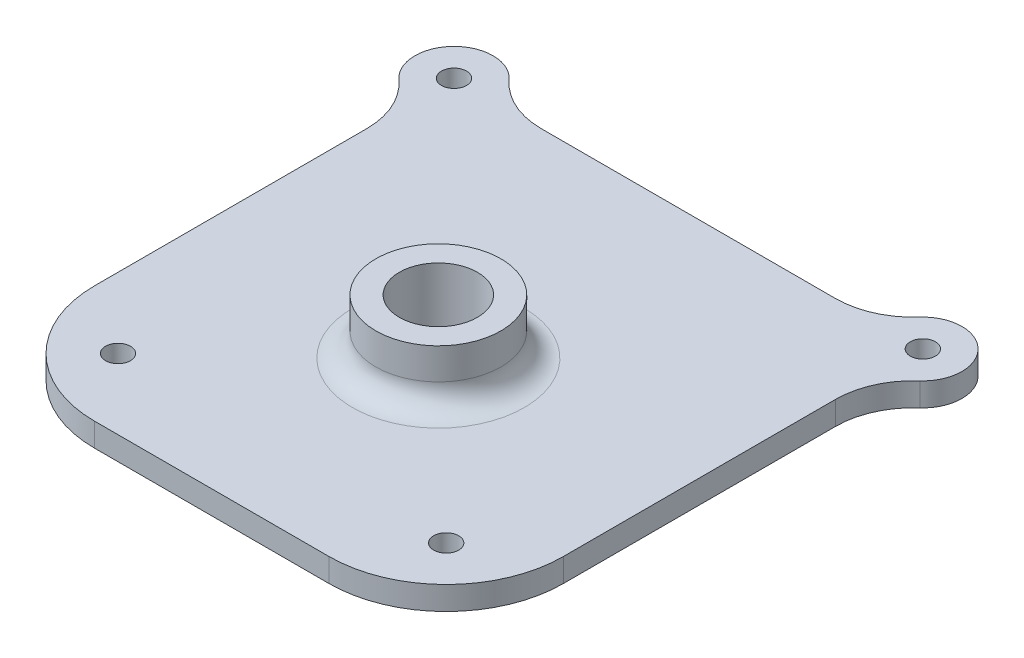
ISO-10303-21;
HEADER;
FILE_DESCRIPTION(('STEP AP214'),'2;1');
FILE_NAME('part.step','',(''),(''),'','','');
FILE_SCHEMA(('AUTOMOTIVE_DESIGN { 1 0 10303 214 1 1 1 1 }'));
ENDSEC;
DATA;
#1=APPLICATION_CONTEXT('core data for automotive mechanical design processes');
#2=APPLICATION_PROTOCOL_DEFINITION('international standard','automotive_design',2000,#1);
#3=PRODUCT_CONTEXT('',#1,'mechanical');
#4=PRODUCT('Part','Part','',(#3));
#5=PRODUCT_RELATED_PRODUCT_CATEGORY('part','',(#4));
#6=PRODUCT_DEFINITION_FORMATION('','',#4);
#7=PRODUCT_DEFINITION_CONTEXT('part definition',#1,'design');
#8=PRODUCT_DEFINITION('design','',#6,#7);
#9=PRODUCT_DEFINITION_SHAPE('','',#8);
#10=(LENGTH_UNIT() NAMED_UNIT(*) SI_UNIT(.MILLI.,.METRE.));
#11=(NAMED_UNIT(*) PLANE_ANGLE_UNIT() SI_UNIT($,.RADIAN.));
#12=(NAMED_UNIT(*) SI_UNIT($,.STERADIAN.) SOLID_ANGLE_UNIT());
#13=UNCERTAINTY_MEASURE_WITH_UNIT(LENGTH_MEASURE(1.E-05),#10,'distance_accuracy_value','');
#14=(GEOMETRIC_REPRESENTATION_CONTEXT(3) GLOBAL_UNCERTAINTY_ASSIGNED_CONTEXT((#13)) GLOBAL_UNIT_ASSIGNED_CONTEXT((#10,
#11,#12)) REPRESENTATION_CONTEXT('',''));
#15=CARTESIAN_POINT('',(0.,0.,0.));
#16=DIRECTION('',(0.,0.,1.));
#17=DIRECTION('',(1.,0.,0.));
#18=AXIS2_PLACEMENT_3D('',#15,#16,#17);
#19=CARTESIAN_POINT('',(0.,10.,0.));
#20=DIRECTION('',(0.,1.,0.));
#21=DIRECTION('',(0.,0.,1.));
#22=AXIS2_PLACEMENT_3D('',#19,#20,#21);
#23=PLANE('',#22);
#24=CARTESIAN_POINT('',(16.,10.,34.));
#25=DIRECTION('',(0.,1.,0.));
#26=DIRECTION('',(0.,0.,1.));
#27=AXIS2_PLACEMENT_3D('',#24,#25,#26);
#28=CIRCLE('',#27,5.);
#29=CARTESIAN_POINT('',(16.,10.,39.));
#30=VERTEX_POINT('',#29);
#31=EDGE_CURVE('E219',#30,#30,#28,.T.);
#32=ORIENTED_EDGE('',*,*,#31,.F.);
#33=EDGE_LOOP('',(#32));
#34=FACE_BOUND('',#33,.T.);
#35=CARTESIAN_POINT('',(16.,10.,34.));
#36=DIRECTION('',(0.,1.,0.));
#37=DIRECTION('',(0.,0.,1.));
#38=AXIS2_PLACEMENT_3D('',#35,#36,#37);
#39=CIRCLE('',#38,8.);
#40=CARTESIAN_POINT('',(16.,10.,42.));
#41=VERTEX_POINT('',#40);
#42=EDGE_CURVE('E237',#41,#41,#39,.T.);
#43=ORIENTED_EDGE('',*,*,#42,.T.);
#44=EDGE_LOOP('',(#43));
#45=FACE_BOUND('',#44,.T.);
#46=ADVANCED_FACE('F34',(#34,#45),#23,.T.);
#47=CARTESIAN_POINT('',(-14.,-13.,63.));
#48=DIRECTION('',(0.,0.,1.));
#49=DIRECTION('',(1.,0.,0.));
#50=AXIS2_PLACEMENT_3D('',#47,#48,#49);
#51=PLANE('',#50);
#52=DIRECTION('',(1.,0.,0.));
#53=VECTOR('',#52,1.);
#54=CARTESIAN_POINT('',(1.,3.,63.));
#55=LINE('',#54,#53);
#56=CARTESIAN_POINT('',(1.,3.,63.));
#57=VERTEX_POINT('',#56);
#58=CARTESIAN_POINT('',(31.,3.,63.));
#59=VERTEX_POINT('',#58);
#60=EDGE_CURVE('E133',#57,#59,#55,.T.);
#61=ORIENTED_EDGE('',*,*,#60,.F.);
#62=DIRECTION('',(0.,-1.,0.));
#63=VECTOR('',#62,1.);
#64=CARTESIAN_POINT('',(1.,10.,63.));
#65=LINE('',#64,#63);
#66=CARTESIAN_POINT('',(1.,0.,63.));
#67=VERTEX_POINT('',#66);
#68=EDGE_CURVE('E49',#57,#67,#65,.T.);
#69=ORIENTED_EDGE('',*,*,#68,.T.);
#70=DIRECTION('',(1.,0.,0.));
#71=VECTOR('',#70,1.);
#72=CARTESIAN_POINT('',(-14.,0.,63.));
#73=LINE('',#72,#71);
#74=CARTESIAN_POINT('',(31.,0.,63.));
#75=VERTEX_POINT('',#74);
#76=EDGE_CURVE('E207',#67,#75,#73,.T.);
#77=ORIENTED_EDGE('',*,*,#76,.T.);
#78=DIRECTION('',(0.,-1.,0.));
#79=VECTOR('',#78,1.);
#80=CARTESIAN_POINT('',(31.,10.,63.));
#81=LINE('',#80,#79);
#82=EDGE_CURVE('E150',#59,#75,#81,.T.);
#83=ORIENTED_EDGE('',*,*,#82,.F.);
#84=EDGE_LOOP('',(#61,#69,#77,#83));
#85=FACE_BOUND('',#84,.T.);
#86=ADVANCED_FACE('F254',(#85),#51,.T.);
#87=CARTESIAN_POINT('',(-14.,-13.,63.));
#88=DIRECTION('',(-1.,0.,0.));
#89=DIRECTION('',(0.,0.,1.));
#90=AXIS2_PLACEMENT_3D('',#87,#88,#89);
#91=PLANE('',#90);
#92=DIRECTION('',(0.,0.,1.));
#93=VECTOR('',#92,1.);
#94=CARTESIAN_POINT('',(-14.,3.,3.6));
#95=LINE('',#94,#93);
#96=CARTESIAN_POINT('',(-14.,3.,13.1803398874989));
#97=VERTEX_POINT('',#96);
#98=CARTESIAN_POINT('',(-14.,3.,48.));
#99=VERTEX_POINT('',#98);
#100=EDGE_CURVE('E479',#97,#99,#95,.T.);
#101=ORIENTED_EDGE('',*,*,#100,.F.);
#102=DIRECTION('',(0.,-1.,0.));
#103=VECTOR('',#102,1.);
#104=CARTESIAN_POINT('',(-14.,3.,13.1803398874989));
#105=LINE('',#104,#103);
#106=CARTESIAN_POINT('',(-14.,0.,13.1803398874989));
#107=VERTEX_POINT('',#106);
#108=EDGE_CURVE('E57',#97,#107,#105,.T.);
#109=ORIENTED_EDGE('',*,*,#108,.T.);
#110=DIRECTION('',(0.,0.,1.));
#111=VECTOR('',#110,1.);
#112=CARTESIAN_POINT('',(-14.,0.,63.));
#113=LINE('',#112,#111);
#114=CARTESIAN_POINT('',(-14.,0.,48.));
#115=VERTEX_POINT('',#114);
#116=EDGE_CURVE('E226',#107,#115,#113,.T.);
#117=ORIENTED_EDGE('',*,*,#116,.T.);
#118=DIRECTION('',(0.,-1.,0.));
#119=VECTOR('',#118,1.);
#120=CARTESIAN_POINT('',(-14.,10.,48.));
#121=LINE('',#120,#119);
#122=EDGE_CURVE('E158',#99,#115,#121,.T.);
#123=ORIENTED_EDGE('',*,*,#122,.F.);
#124=EDGE_LOOP('',(#101,#109,#117,#123));
#125=FACE_BOUND('',#124,.T.);
#126=ADVANCED_FACE('F261',(#125),#91,.T.);
#127=CARTESIAN_POINT('',(46.,-13.,63.));
#128=DIRECTION('',(1.,0.,0.));
#129=DIRECTION('',(0.,0.,-1.));
#130=AXIS2_PLACEMENT_3D('',#127,#128,#129);
#131=PLANE('',#130);
#132=DIRECTION('',(0.,0.,-1.));
#133=VECTOR('',#132,1.);
#134=CARTESIAN_POINT('',(46.,3.,48.));
#135=LINE('',#134,#133);
#136=CARTESIAN_POINT('',(46.,3.,48.));
#137=VERTEX_POINT('',#136);
#138=CARTESIAN_POINT('',(46.,3.,13.1803398874989));
#139=VERTEX_POINT('',#138);
#140=EDGE_CURVE('E131',#137,#139,#135,.T.);
#141=ORIENTED_EDGE('',*,*,#140,.F.);
#142=DIRECTION('',(0.,-1.,0.));
#143=VECTOR('',#142,1.);
#144=CARTESIAN_POINT('',(46.,10.,48.));
#145=LINE('',#144,#143);
#146=CARTESIAN_POINT('',(46.,0.,48.));
#147=VERTEX_POINT('',#146);
#148=EDGE_CURVE('E140',#137,#147,#145,.T.);
#149=ORIENTED_EDGE('',*,*,#148,.T.);
#150=DIRECTION('',(0.,0.,-1.));
#151=VECTOR('',#150,1.);
#152=CARTESIAN_POINT('',(46.,0.,63.));
#153=LINE('',#152,#151);
#154=CARTESIAN_POINT('',(46.,0.,13.1803398874989));
#155=VERTEX_POINT('',#154);
#156=EDGE_CURVE('E216',#147,#155,#153,.T.);
#157=ORIENTED_EDGE('',*,*,#156,.T.);
#158=DIRECTION('',(0.,-1.,0.));
#159=VECTOR('',#158,1.);
#160=CARTESIAN_POINT('',(46.,3.,13.1803398874989));
#161=LINE('',#160,#159);
#162=EDGE_CURVE('E143',#139,#155,#161,.T.);
#163=ORIENTED_EDGE('',*,*,#162,.F.);
#164=EDGE_LOOP('',(#141,#149,#157,#163));
#165=FACE_BOUND('',#164,.T.);
#166=ADVANCED_FACE('F139',(#165),#131,.T.);
#167=CARTESIAN_POINT('',(-11.,0.,40.1668893036197));
#168=DIRECTION('',(0.,-1.,0.));
#169=DIRECTION('',(0.,0.,-1.));
#170=AXIS2_PLACEMENT_3D('',#167,#168,#169);
#171=PLANE('',#170);
#172=CARTESIAN_POINT('',(37.,0.,54.));
#173=DIRECTION('',(0.,1.,0.));
#174=DIRECTION('',(0.,0.,1.));
#175=AXIS2_PLACEMENT_3D('',#172,#173,#174);
#176=CIRCLE('',#175,1.6);
#177=CARTESIAN_POINT('',(37.,0.,55.6));
#178=VERTEX_POINT('',#177);
#179=EDGE_CURVE('E492',#178,#178,#176,.T.);
#180=ORIENTED_EDGE('',*,*,#179,.T.);
#181=EDGE_LOOP('',(#180));
#182=FACE_BOUND('',#181,.T.);
#183=CARTESIAN_POINT('',(46.,0.,1.99999999999999));
#184=DIRECTION('',(0.,1.,0.));
#185=DIRECTION('',(0.,0.,1.));
#186=AXIS2_PLACEMENT_3D('',#183,#184,#185);
#187=CIRCLE('',#186,1.6);
#188=CARTESIAN_POINT('',(46.,0.,3.59999999999999));
#189=VERTEX_POINT('',#188);
#190=EDGE_CURVE('E495',#189,#189,#187,.T.);
#191=ORIENTED_EDGE('',*,*,#190,.T.);
#192=EDGE_LOOP('',(#191));
#193=FACE_BOUND('',#192,.T.);
#194=CARTESIAN_POINT('',(-5.,0.,54.));
#195=DIRECTION('',(0.,1.,0.));
#196=DIRECTION('',(0.,0.,1.));
#197=AXIS2_PLACEMENT_3D('',#194,#195,#196);
#198=CIRCLE('',#197,1.6);
#199=CARTESIAN_POINT('',(-5.,0.,55.6));
#200=VERTEX_POINT('',#199);
#201=EDGE_CURVE('E498',#200,#200,#198,.T.);
#202=ORIENTED_EDGE('',*,*,#201,.T.);
#203=EDGE_LOOP('',(#202));
#204=FACE_BOUND('',#203,.T.);
#205=CARTESIAN_POINT('',(-14.,0.,2.));
#206=DIRECTION('',(0.,1.,0.));
#207=DIRECTION('',(0.,0.,1.));
#208=AXIS2_PLACEMENT_3D('',#205,#206,#207);
#209=CIRCLE('',#208,1.6);
#210=CARTESIAN_POINT('',(-14.,0.,3.6));
#211=VERTEX_POINT('',#210);
#212=EDGE_CURVE('E154',#211,#211,#209,.T.);
#213=ORIENTED_EDGE('',*,*,#212,.T.);
#214=EDGE_LOOP('',(#213));
#215=FACE_BOUND('',#214,.T.);
#216=CARTESIAN_POINT('',(31.,0.,48.));
#217=DIRECTION('',(0.,1.,0.));
#218=DIRECTION('',(0.,0.,-1.));
#219=AXIS2_PLACEMENT_3D('',#216,#217,#218);
#220=CIRCLE('',#219,15.);
#221=EDGE_CURVE('E148',#75,#147,#220,.T.);
#222=ORIENTED_EDGE('',*,*,#221,.F.);
#223=ORIENTED_EDGE('',*,*,#76,.F.);
#224=CARTESIAN_POINT('',(1.,0.,48.));
#225=DIRECTION('',(0.,1.,0.));
#226=DIRECTION('',(0.,0.,-1.));
#227=AXIS2_PLACEMENT_3D('',#224,#225,#226);
#228=CIRCLE('',#227,15.);
#229=EDGE_CURVE('E152',#115,#67,#228,.T.);
#230=ORIENTED_EDGE('',*,*,#229,.F.);
#231=ORIENTED_EDGE('',*,*,#116,.F.);
#232=CARTESIAN_POINT('',(-24.,0.,13.1803398874989));
#233=DIRECTION('',(0.,1.,0.));
#234=DIRECTION('',(0.,0.,-1.));
#235=AXIS2_PLACEMENT_3D('',#232,#233,#234);
#236=CIRCLE('',#235,10.);
#237=CARTESIAN_POINT('',(-17.3333333333333,0.,5.72677996249965));
#238=VERTEX_POINT('',#237);
#239=EDGE_CURVE('E175',#107,#238,#236,.T.);
#240=ORIENTED_EDGE('',*,*,#239,.T.);
#241=CARTESIAN_POINT('',(-14.,0.,2.));
#242=DIRECTION('',(0.,-1.,0.));
#243=DIRECTION('',(0.,0.,-1.));
#244=AXIS2_PLACEMENT_3D('',#241,#242,#243);
#245=CIRCLE('',#244,5.);
#246=CARTESIAN_POINT('',(-10.2732200375003,0.,-1.33333333333334));
#247=VERTEX_POINT('',#246);
#248=EDGE_CURVE('E166',#238,#247,#245,.T.);
#249=ORIENTED_EDGE('',*,*,#248,.T.);
#250=CARTESIAN_POINT('',(-2.81966011250105,0.,-8.));
#251=DIRECTION('',(0.,1.,0.));
#252=DIRECTION('',(0.,0.,-1.));
#253=AXIS2_PLACEMENT_3D('',#250,#251,#252);
#254=CIRCLE('',#253,10.);
#255=CARTESIAN_POINT('',(-2.81966011250105,0.,2.));
#256=VERTEX_POINT('',#255);
#257=EDGE_CURVE('E160',#247,#256,#254,.T.);
#258=ORIENTED_EDGE('',*,*,#257,.T.);
#259=DIRECTION('',(-1.,0.,0.));
#260=VECTOR('',#259,1.);
#261=CARTESIAN_POINT('',(-14.,0.,2.));
#262=LINE('',#261,#260);
#263=CARTESIAN_POINT('',(34.8196601125011,0.,2.));
#264=VERTEX_POINT('',#263);
#265=EDGE_CURVE('E224',#264,#256,#262,.T.);
#266=ORIENTED_EDGE('',*,*,#265,.F.);
#267=CARTESIAN_POINT('',(34.8196601125011,0.,-8.00000000000001));
#268=DIRECTION('',(0.,1.,0.));
#269=DIRECTION('',(0.,0.,-1.));
#270=AXIS2_PLACEMENT_3D('',#267,#268,#269);
#271=CIRCLE('',#270,10.);
#272=CARTESIAN_POINT('',(42.2732200375004,0.,-1.33333333333333));
#273=VERTEX_POINT('',#272);
#274=EDGE_CURVE('E182',#264,#273,#271,.T.);
#275=ORIENTED_EDGE('',*,*,#274,.T.);
#276=CARTESIAN_POINT('',(46.,0.,1.99999999999999));
#277=DIRECTION('',(0.,-1.,0.));
#278=DIRECTION('',(0.,0.,-1.));
#279=AXIS2_PLACEMENT_3D('',#276,#277,#278);
#280=CIRCLE('',#279,5.);
#281=CARTESIAN_POINT('',(49.3333333333333,0.,5.72677996249964));
#282=VERTEX_POINT('',#281);
#283=EDGE_CURVE('E200',#273,#282,#280,.T.);
#284=ORIENTED_EDGE('',*,*,#283,.T.);
#285=CARTESIAN_POINT('',(56.,0.,13.1803398874989));
#286=DIRECTION('',(0.,1.,0.));
#287=DIRECTION('',(0.,0.,-1.));
#288=AXIS2_PLACEMENT_3D('',#285,#286,#287);
#289=CIRCLE('',#288,10.);
#290=EDGE_CURVE('E192',#282,#155,#289,.T.);
#291=ORIENTED_EDGE('',*,*,#290,.T.);
#292=ORIENTED_EDGE('',*,*,#156,.F.);
#293=EDGE_LOOP('',(#222,#223,#230,#231,#240,#249,#258,#266,#275,#284,#291,#292));
#294=FACE_BOUND('',#293,.T.);
#295=CARTESIAN_POINT('',(16.,0.,34.));
#296=DIRECTION('',(0.,-1.,0.));
#297=DIRECTION('',(0.,0.,-1.));
#298=AXIS2_PLACEMENT_3D('',#295,#296,#297);
#299=CIRCLE('',#298,6.);
#300=CARTESIAN_POINT('',(16.,0.,28.));
#301=VERTEX_POINT('',#300);
#302=EDGE_CURVE('E212',#301,#301,#299,.T.);
#303=ORIENTED_EDGE('',*,*,#302,.F.);
#304=EDGE_LOOP('',(#303));
#305=FACE_BOUND('',#304,.T.);
#306=ADVANCED_FACE('F274',(#182,#193,#204,#215,#294,#305),#171,.T.);
#307=CARTESIAN_POINT('',(-14.,-13.,2.));
#308=DIRECTION('',(0.,0.,-1.));
#309=DIRECTION('',(-1.,0.,0.));
#310=AXIS2_PLACEMENT_3D('',#307,#308,#309);
#311=PLANE('',#310);
#312=DIRECTION('',(-1.,0.,0.));
#313=VECTOR('',#312,1.);
#314=CARTESIAN_POINT('',(44.4,3.,1.99999999999999));
#315=LINE('',#314,#313);
#316=CARTESIAN_POINT('',(34.8196601125011,3.,2.));
#317=VERTEX_POINT('',#316);
#318=CARTESIAN_POINT('',(-2.81966011250105,3.,2.));
#319=VERTEX_POINT('',#318);
#320=EDGE_CURVE('E470',#317,#319,#315,.T.);
#321=ORIENTED_EDGE('',*,*,#320,.F.);
#322=DIRECTION('',(0.,-1.,0.));
#323=VECTOR('',#322,1.);
#324=CARTESIAN_POINT('',(34.8196601125011,3.,2.));
#325=LINE('',#324,#323);
#326=EDGE_CURVE('E205',#317,#264,#325,.T.);
#327=ORIENTED_EDGE('',*,*,#326,.T.);
#328=ORIENTED_EDGE('',*,*,#265,.T.);
#329=DIRECTION('',(0.,-1.,0.));
#330=VECTOR('',#329,1.);
#331=CARTESIAN_POINT('',(-2.81966011250105,3.,2.));
#332=LINE('',#331,#330);
#333=EDGE_CURVE('E172',#319,#256,#332,.T.);
#334=ORIENTED_EDGE('',*,*,#333,.F.);
#335=EDGE_LOOP('',(#321,#327,#328,#334));
#336=FACE_BOUND('',#335,.T.);
#337=ADVANCED_FACE('F277',(#336),#311,.T.);
#338=CARTESIAN_POINT('',(16.,10.,34.));
#339=DIRECTION('',(0.,-1.,0.));
#340=DIRECTION('',(0.,0.,-1.));
#341=AXIS2_PLACEMENT_3D('',#338,#339,#340);
#342=CYLINDRICAL_SURFACE('',#341,5.);
#343=CARTESIAN_POINT('',(16.,0.999999999999999,34.));
#344=DIRECTION('',(0.,-1.,0.));
#345=DIRECTION('',(0.,0.,-1.));
#346=AXIS2_PLACEMENT_3D('',#343,#344,#345);
#347=CIRCLE('',#346,5.);
#348=CARTESIAN_POINT('',(16.,0.999999999999999,29.));
#349=VERTEX_POINT('',#348);
#350=EDGE_CURVE('E215',#349,#349,#347,.F.);
#351=ORIENTED_EDGE('',*,*,#350,.F.);
#352=EDGE_LOOP('',(#351));
#353=FACE_BOUND('',#352,.T.);
#354=ORIENTED_EDGE('',*,*,#31,.T.);
#355=EDGE_LOOP('',(#354));
#356=FACE_BOUND('',#355,.T.);
#357=ADVANCED_FACE('F272',(#353,#356),#342,.F.);
#358=CARTESIAN_POINT('',(16.,0.999999999999999,34.));
#359=DIRECTION('',(0.,-1.,0.));
#360=DIRECTION('',(0.,0.,-1.));
#361=AXIS2_PLACEMENT_3D('',#358,#359,#360);
#362=TOROIDAL_SURFACE('',#361,6.,1.);
#363=ORIENTED_EDGE('',*,*,#302,.T.);
#364=EDGE_LOOP('',(#363));
#365=FACE_BOUND('',#364,.T.);
#366=ORIENTED_EDGE('',*,*,#350,.T.);
#367=EDGE_LOOP('',(#366));
#368=FACE_BOUND('',#367,.T.);
#369=ADVANCED_FACE('F269',(#365,#368),#362,.T.);
#370=CARTESIAN_POINT('',(34.8196601125011,3.,-8.00000000000001));
#371=DIRECTION('',(0.,-1.,0.));
#372=DIRECTION('',(0.,0.,-1.));
#373=AXIS2_PLACEMENT_3D('',#370,#371,#372);
#374=CYLINDRICAL_SURFACE('',#373,10.);
#375=ORIENTED_EDGE('',*,*,#274,.F.);
#376=ORIENTED_EDGE('',*,*,#326,.F.);
#377=CARTESIAN_POINT('',(34.8196601125011,3.,-8.00000000000001));
#378=DIRECTION('',(0.,1.,0.));
#379=DIRECTION('',(0.,0.,-1.));
#380=AXIS2_PLACEMENT_3D('',#377,#378,#379);
#381=CIRCLE('',#380,10.);
#382=CARTESIAN_POINT('',(42.2732200375004,3.,-1.33333333333333));
#383=VERTEX_POINT('',#382);
#384=EDGE_CURVE('E188',#317,#383,#381,.T.);
#385=ORIENTED_EDGE('',*,*,#384,.T.);
#386=DIRECTION('',(0.,-1.,0.));
#387=VECTOR('',#386,1.);
#388=CARTESIAN_POINT('',(42.2732200375004,3.,-1.33333333333333));
#389=LINE('',#388,#387);
#390=EDGE_CURVE('E197',#383,#273,#389,.T.);
#391=ORIENTED_EDGE('',*,*,#390,.T.);
#392=EDGE_LOOP('',(#375,#376,#385,#391));
#393=FACE_BOUND('',#392,.T.);
#394=ADVANCED_FACE('F267',(#393),#374,.F.);
#395=CARTESIAN_POINT('',(56.,3.,13.1803398874989));
#396=DIRECTION('',(0.,-1.,0.));
#397=DIRECTION('',(0.,0.,-1.));
#398=AXIS2_PLACEMENT_3D('',#395,#396,#397);
#399=CYLINDRICAL_SURFACE('',#398,10.);
#400=ORIENTED_EDGE('',*,*,#290,.F.);
#401=DIRECTION('',(0.,-1.,0.));
#402=VECTOR('',#401,1.);
#403=CARTESIAN_POINT('',(49.3333333333333,3.,5.72677996249964));
#404=LINE('',#403,#402);
#405=CARTESIAN_POINT('',(49.3333333333333,3.,5.72677996249964));
#406=VERTEX_POINT('',#405);
#407=EDGE_CURVE('E209',#406,#282,#404,.T.);
#408=ORIENTED_EDGE('',*,*,#407,.F.);
#409=CARTESIAN_POINT('',(56.,3.,13.1803398874989));
#410=DIRECTION('',(0.,1.,0.));
#411=DIRECTION('',(0.,0.,-1.));
#412=AXIS2_PLACEMENT_3D('',#409,#410,#411);
#413=CIRCLE('',#412,10.);
#414=EDGE_CURVE('E195',#406,#139,#413,.T.);
#415=ORIENTED_EDGE('',*,*,#414,.T.);
#416=ORIENTED_EDGE('',*,*,#162,.T.);
#417=EDGE_LOOP('',(#400,#408,#415,#416));
#418=FACE_BOUND('',#417,.T.);
#419=ADVANCED_FACE('F304',(#418),#399,.F.);
#420=CARTESIAN_POINT('',(46.,3.,1.99999999999999));
#421=DIRECTION('',(0.,-1.,0.));
#422=DIRECTION('',(0.,0.,-1.));
#423=AXIS2_PLACEMENT_3D('',#420,#421,#422);
#424=CYLINDRICAL_SURFACE('',#423,5.);
#425=ORIENTED_EDGE('',*,*,#283,.F.);
#426=ORIENTED_EDGE('',*,*,#390,.F.);
#427=CARTESIAN_POINT('',(46.,3.,1.99999999999999));
#428=DIRECTION('',(0.,-1.,0.));
#429=DIRECTION('',(0.,0.,-1.));
#430=AXIS2_PLACEMENT_3D('',#427,#428,#429);
#431=CIRCLE('',#430,5.);
#432=EDGE_CURVE('E191',#383,#406,#431,.T.);
#433=ORIENTED_EDGE('',*,*,#432,.T.);
#434=ORIENTED_EDGE('',*,*,#407,.T.);
#435=EDGE_LOOP('',(#425,#426,#433,#434));
#436=FACE_BOUND('',#435,.T.);
#437=ADVANCED_FACE('F311',(#436),#424,.T.);
#438=CARTESIAN_POINT('',(34.8196601125011,3.,-8.00000000000001));
#439=DIRECTION('',(0.,-1.,0.));
#440=DIRECTION('',(0.,0.,-1.));
#441=AXIS2_PLACEMENT_3D('',#438,#439,#440);
#442=PLANE('',#441);
#443=CARTESIAN_POINT('',(16.,3.,34.));
#444=DIRECTION('',(0.,-1.,0.));
#445=DIRECTION('',(0.,0.,-1.));
#446=AXIS2_PLACEMENT_3D('',#443,#444,#445);
#447=CIRCLE('',#446,11.);
#448=CARTESIAN_POINT('',(16.,3.,23.));
#449=VERTEX_POINT('',#448);
#450=EDGE_CURVE('E11',#449,#449,#447,.T.);
#451=ORIENTED_EDGE('',*,*,#450,.T.);
#452=EDGE_LOOP('',(#451));
#453=FACE_BOUND('',#452,.T.);
#454=CARTESIAN_POINT('',(46.,3.,1.99999999999999));
#455=DIRECTION('',(0.,-1.,0.));
#456=DIRECTION('',(0.,0.,-1.));
#457=AXIS2_PLACEMENT_3D('',#454,#455,#456);
#458=CIRCLE('',#457,1.6);
#459=CARTESIAN_POINT('',(46.,3.,0.399999999999997));
#460=VERTEX_POINT('',#459);
#461=EDGE_CURVE('E231',#460,#460,#458,.T.);
#462=ORIENTED_EDGE('',*,*,#461,.T.);
#463=EDGE_LOOP('',(#462));
#464=FACE_BOUND('',#463,.T.);
#465=ORIENTED_EDGE('',*,*,#384,.F.);
#466=ORIENTED_EDGE('',*,*,#320,.T.);
#467=CARTESIAN_POINT('',(-2.81966011250105,3.,-8.));
#468=DIRECTION('',(0.,1.,0.));
#469=DIRECTION('',(0.,0.,-1.));
#470=AXIS2_PLACEMENT_3D('',#467,#468,#469);
#471=CIRCLE('',#470,10.);
#472=CARTESIAN_POINT('',(-10.2732200375003,3.,-1.33333333333334));
#473=VERTEX_POINT('',#472);
#474=EDGE_CURVE('E162',#473,#319,#471,.T.);
#475=ORIENTED_EDGE('',*,*,#474,.F.);
#476=CARTESIAN_POINT('',(-14.,3.,2.));
#477=DIRECTION('',(0.,-1.,0.));
#478=DIRECTION('',(0.,0.,-1.));
#479=AXIS2_PLACEMENT_3D('',#476,#477,#478);
#480=CIRCLE('',#479,5.);
#481=CARTESIAN_POINT('',(-17.3333333333333,3.,5.72677996249965));
#482=VERTEX_POINT('',#481);
#483=EDGE_CURVE('E169',#482,#473,#480,.T.);
#484=ORIENTED_EDGE('',*,*,#483,.F.);
#485=CARTESIAN_POINT('',(-24.,3.,13.1803398874989));
#486=DIRECTION('',(0.,1.,0.));
#487=DIRECTION('',(0.,0.,-1.));
#488=AXIS2_PLACEMENT_3D('',#485,#486,#487);
#489=CIRCLE('',#488,10.);
#490=EDGE_CURVE('E165',#97,#482,#489,.T.);
#491=ORIENTED_EDGE('',*,*,#490,.F.);
#492=ORIENTED_EDGE('',*,*,#100,.T.);
#493=CARTESIAN_POINT('',(1.,3.,48.));
#494=DIRECTION('',(0.,-1.,0.));
#495=DIRECTION('',(0.,0.,-1.));
#496=AXIS2_PLACEMENT_3D('',#493,#494,#495);
#497=CIRCLE('',#496,15.);
#498=EDGE_CURVE('E474',#99,#57,#497,.F.);
#499=ORIENTED_EDGE('',*,*,#498,.T.);
#500=ORIENTED_EDGE('',*,*,#60,.T.);
#501=CARTESIAN_POINT('',(31.,3.,48.));
#502=DIRECTION('',(0.,-1.,0.));
#503=DIRECTION('',(0.,0.,-1.));
#504=AXIS2_PLACEMENT_3D('',#501,#502,#503);
#505=CIRCLE('',#504,15.);
#506=EDGE_CURVE('E125',#59,#137,#505,.F.);
#507=ORIENTED_EDGE('',*,*,#506,.T.);
#508=ORIENTED_EDGE('',*,*,#140,.T.);
#509=ORIENTED_EDGE('',*,*,#414,.F.);
#510=ORIENTED_EDGE('',*,*,#432,.F.);
#511=EDGE_LOOP('',(#465,#466,#475,#484,#491,#492,#499,#500,#507,#508,#509,#510));
#512=FACE_BOUND('',#511,.T.);
#513=CARTESIAN_POINT('',(-14.,3.,2.));
#514=DIRECTION('',(0.,-1.,0.));
#515=DIRECTION('',(0.,0.,-1.));
#516=AXIS2_PLACEMENT_3D('',#513,#514,#515);
#517=CIRCLE('',#516,1.6);
#518=CARTESIAN_POINT('',(-14.,3.,0.399999999999995));
#519=VERTEX_POINT('',#518);
#520=EDGE_CURVE('E222',#519,#519,#517,.T.);
#521=ORIENTED_EDGE('',*,*,#520,.T.);
#522=EDGE_LOOP('',(#521));
#523=FACE_BOUND('',#522,.T.);
#524=CARTESIAN_POINT('',(37.,3.,54.));
#525=DIRECTION('',(0.,-1.,0.));
#526=DIRECTION('',(0.,0.,-1.));
#527=AXIS2_PLACEMENT_3D('',#524,#525,#526);
#528=CIRCLE('',#527,1.6);
#529=CARTESIAN_POINT('',(37.,3.,52.4));
#530=VERTEX_POINT('',#529);
#531=EDGE_CURVE('E234',#530,#530,#528,.F.);
#532=ORIENTED_EDGE('',*,*,#531,.F.);
#533=EDGE_LOOP('',(#532));
#534=FACE_BOUND('',#533,.T.);
#535=CARTESIAN_POINT('',(-5.,3.,54.));
#536=DIRECTION('',(0.,-1.,0.));
#537=DIRECTION('',(0.,0.,-1.));
#538=AXIS2_PLACEMENT_3D('',#535,#536,#537);
#539=CIRCLE('',#538,1.6);
#540=CARTESIAN_POINT('',(-5.,3.,52.4));
#541=VERTEX_POINT('',#540);
#542=EDGE_CURVE('E236',#541,#541,#539,.F.);
#543=ORIENTED_EDGE('',*,*,#542,.F.);
#544=EDGE_LOOP('',(#543));
#545=FACE_BOUND('',#544,.T.);
#546=ADVANCED_FACE('F128',(#453,#464,#512,#523,#534,#545),#442,.F.);
#547=CARTESIAN_POINT('',(-2.81966011250105,3.,-8.));
#548=DIRECTION('',(0.,-1.,0.));
#549=DIRECTION('',(0.,0.,-1.));
#550=AXIS2_PLACEMENT_3D('',#547,#548,#549);
#551=CYLINDRICAL_SURFACE('',#550,10.);
#552=ORIENTED_EDGE('',*,*,#257,.F.);
#553=DIRECTION('',(0.,-1.,0.));
#554=VECTOR('',#553,1.);
#555=CARTESIAN_POINT('',(-10.2732200375003,3.,-1.33333333333334));
#556=LINE('',#555,#554);
#557=EDGE_CURVE('E180',#473,#247,#556,.T.);
#558=ORIENTED_EDGE('',*,*,#557,.F.);
#559=ORIENTED_EDGE('',*,*,#474,.T.);
#560=ORIENTED_EDGE('',*,*,#333,.T.);
#561=EDGE_LOOP('',(#552,#558,#559,#560));
#562=FACE_BOUND('',#561,.T.);
#563=ADVANCED_FACE('F317',(#562),#551,.F.);
#564=CARTESIAN_POINT('',(-14.,3.,2.));
#565=DIRECTION('',(0.,-1.,0.));
#566=DIRECTION('',(0.,0.,-1.));
#567=AXIS2_PLACEMENT_3D('',#564,#565,#566);
#568=CYLINDRICAL_SURFACE('',#567,5.);
#569=ORIENTED_EDGE('',*,*,#248,.F.);
#570=DIRECTION('',(0.,-1.,0.));
#571=VECTOR('',#570,1.);
#572=CARTESIAN_POINT('',(-17.3333333333333,3.,5.72677996249965));
#573=LINE('',#572,#571);
#574=EDGE_CURVE('E183',#482,#238,#573,.T.);
#575=ORIENTED_EDGE('',*,*,#574,.F.);
#576=ORIENTED_EDGE('',*,*,#483,.T.);
#577=ORIENTED_EDGE('',*,*,#557,.T.);
#578=EDGE_LOOP('',(#569,#575,#576,#577));
#579=FACE_BOUND('',#578,.T.);
#580=ADVANCED_FACE('F321',(#579),#568,.T.);
#581=CARTESIAN_POINT('',(-24.,3.,13.1803398874989));
#582=DIRECTION('',(0.,-1.,0.));
#583=DIRECTION('',(0.,0.,-1.));
#584=AXIS2_PLACEMENT_3D('',#581,#582,#583);
#585=CYLINDRICAL_SURFACE('',#584,10.);
#586=ORIENTED_EDGE('',*,*,#239,.F.);
#587=ORIENTED_EDGE('',*,*,#108,.F.);
#588=ORIENTED_EDGE('',*,*,#490,.T.);
#589=ORIENTED_EDGE('',*,*,#574,.T.);
#590=EDGE_LOOP('',(#586,#587,#588,#589));
#591=FACE_BOUND('',#590,.T.);
#592=ADVANCED_FACE('F327',(#591),#585,.F.);
#593=CARTESIAN_POINT('',(1.,10.,48.));
#594=DIRECTION('',(0.,-1.,0.));
#595=DIRECTION('',(0.,0.,-1.));
#596=AXIS2_PLACEMENT_3D('',#593,#594,#595);
#597=CYLINDRICAL_SURFACE('',#596,15.);
#598=ORIENTED_EDGE('',*,*,#68,.F.);
#599=ORIENTED_EDGE('',*,*,#498,.F.);
#600=ORIENTED_EDGE('',*,*,#122,.T.);
#601=ORIENTED_EDGE('',*,*,#229,.T.);
#602=EDGE_LOOP('',(#598,#599,#600,#601));
#603=FACE_BOUND('',#602,.T.);
#604=ADVANCED_FACE('F331',(#603),#597,.T.);
#605=CARTESIAN_POINT('',(31.,10.,48.));
#606=DIRECTION('',(0.,-1.,0.));
#607=DIRECTION('',(0.,0.,-1.));
#608=AXIS2_PLACEMENT_3D('',#605,#606,#607);
#609=CYLINDRICAL_SURFACE('',#608,15.);
#610=ORIENTED_EDGE('',*,*,#148,.F.);
#611=ORIENTED_EDGE('',*,*,#506,.F.);
#612=ORIENTED_EDGE('',*,*,#82,.T.);
#613=ORIENTED_EDGE('',*,*,#221,.T.);
#614=EDGE_LOOP('',(#610,#611,#612,#613));
#615=FACE_BOUND('',#614,.T.);
#616=ADVANCED_FACE('F146',(#615),#609,.T.);
#617=CARTESIAN_POINT('',(-14.,0.,2.));
#618=DIRECTION('',(0.,1.,0.));
#619=DIRECTION('',(0.,0.,1.));
#620=AXIS2_PLACEMENT_3D('',#617,#618,#619);
#621=CYLINDRICAL_SURFACE('',#620,1.6);
#622=ORIENTED_EDGE('',*,*,#520,.F.);
#623=EDGE_LOOP('',(#622));
#624=FACE_BOUND('',#623,.T.);
#625=ORIENTED_EDGE('',*,*,#212,.F.);
#626=EDGE_LOOP('',(#625));
#627=FACE_BOUND('',#626,.T.);
#628=ADVANCED_FACE('F346',(#624,#627),#621,.F.);
#629=CARTESIAN_POINT('',(-5.,0.,54.));
#630=DIRECTION('',(0.,1.,0.));
#631=DIRECTION('',(0.,0.,1.));
#632=AXIS2_PLACEMENT_3D('',#629,#630,#631);
#633=CYLINDRICAL_SURFACE('',#632,1.6);
#634=ORIENTED_EDGE('',*,*,#542,.T.);
#635=EDGE_LOOP('',(#634));
#636=FACE_BOUND('',#635,.T.);
#637=ORIENTED_EDGE('',*,*,#201,.F.);
#638=EDGE_LOOP('',(#637));
#639=FACE_BOUND('',#638,.T.);
#640=ADVANCED_FACE('F353',(#636,#639),#633,.F.);
#641=CARTESIAN_POINT('',(46.,0.,1.99999999999999));
#642=DIRECTION('',(0.,1.,0.));
#643=DIRECTION('',(0.,0.,1.));
#644=AXIS2_PLACEMENT_3D('',#641,#642,#643);
#645=CYLINDRICAL_SURFACE('',#644,1.6);
#646=ORIENTED_EDGE('',*,*,#461,.F.);
#647=EDGE_LOOP('',(#646));
#648=FACE_BOUND('',#647,.T.);
#649=ORIENTED_EDGE('',*,*,#190,.F.);
#650=EDGE_LOOP('',(#649));
#651=FACE_BOUND('',#650,.T.);
#652=ADVANCED_FACE('F361',(#648,#651),#645,.F.);
#653=CARTESIAN_POINT('',(37.,0.,54.));
#654=DIRECTION('',(0.,1.,0.));
#655=DIRECTION('',(0.,0.,1.));
#656=AXIS2_PLACEMENT_3D('',#653,#654,#655);
#657=CYLINDRICAL_SURFACE('',#656,1.6);
#658=ORIENTED_EDGE('',*,*,#531,.T.);
#659=EDGE_LOOP('',(#658));
#660=FACE_BOUND('',#659,.T.);
#661=ORIENTED_EDGE('',*,*,#179,.F.);
#662=EDGE_LOOP('',(#661));
#663=FACE_BOUND('',#662,.T.);
#664=ADVANCED_FACE('F250',(#660,#663),#657,.F.);
#665=CARTESIAN_POINT('',(16.,-82.5628424025289,34.));
#666=DIRECTION('',(0.,1.,0.));
#667=DIRECTION('',(0.,0.,1.));
#668=AXIS2_PLACEMENT_3D('',#665,#666,#667);
#669=CYLINDRICAL_SURFACE('',#668,8.);
#670=CARTESIAN_POINT('',(16.,6.00000000000001,34.));
#671=DIRECTION('',(0.,-1.,0.));
#672=DIRECTION('',(0.,0.,-1.));
#673=AXIS2_PLACEMENT_3D('',#670,#671,#672);
#674=CIRCLE('',#673,8.);
#675=CARTESIAN_POINT('',(16.,6.00000000000001,26.));
#676=VERTEX_POINT('',#675);
#677=EDGE_CURVE('E42',#676,#676,#674,.F.);
#678=ORIENTED_EDGE('',*,*,#677,.T.);
#679=EDGE_LOOP('',(#678));
#680=FACE_BOUND('',#679,.T.);
#681=ORIENTED_EDGE('',*,*,#42,.F.);
#682=EDGE_LOOP('',(#681));
#683=FACE_BOUND('',#682,.T.);
#684=ADVANCED_FACE('F241',(#680,#683),#669,.T.);
#685=CARTESIAN_POINT('',(16.,6.00000000000001,34.));
#686=DIRECTION('',(0.,-1.,0.));
#687=DIRECTION('',(0.,0.,-1.));
#688=AXIS2_PLACEMENT_3D('',#685,#686,#687);
#689=TOROIDAL_SURFACE('',#688,11.,3.);
#690=ORIENTED_EDGE('',*,*,#450,.F.);
#691=EDGE_LOOP('',(#690));
#692=FACE_BOUND('',#691,.T.);
#693=ORIENTED_EDGE('',*,*,#677,.F.);
#694=EDGE_LOOP('',(#693));
#695=FACE_BOUND('',#694,.T.);
#696=ADVANCED_FACE('F36',(#692,#695),#689,.F.);
#697=CLOSED_SHELL('',(#46,#86,#126,#166,#306,#337,#357,#369,#394,#419,#437,#546,#563,#580,#592,
#604,#616,#628,#640,#652,#664,#684,#696));
#698=MANIFOLD_SOLID_BREP('B2',#697);
#699=ADVANCED_BREP_SHAPE_REPRESENTATION('',(#18,#698),#14);
#700=SHAPE_DEFINITION_REPRESENTATION(#9,#699);
ENDSEC;
END-ISO-10303-21;
